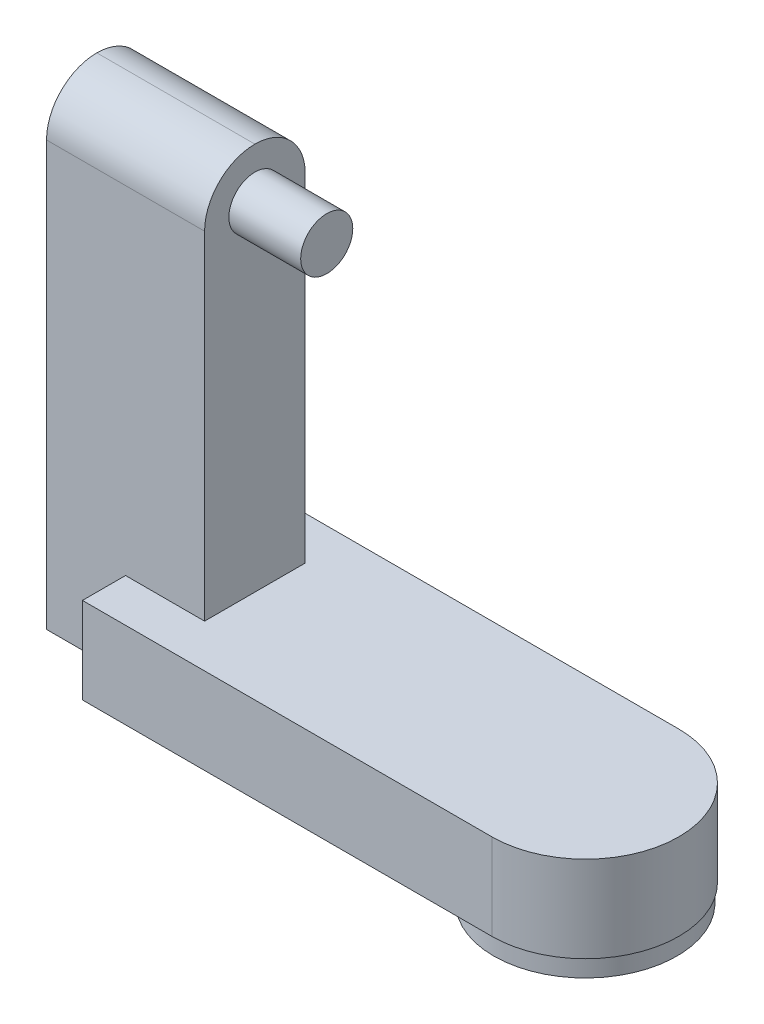
ISO-10303-21;
HEADER;
FILE_DESCRIPTION(('STEP AP214'),'2;1');
FILE_NAME('part.step','',(''),(''),'','','');
FILE_SCHEMA(('AUTOMOTIVE_DESIGN { 1 0 10303 214 1 1 1 1 }'));
ENDSEC;
DATA;
#1=APPLICATION_CONTEXT('core data for automotive mechanical design processes');
#2=APPLICATION_PROTOCOL_DEFINITION('international standard','automotive_design',2000,#1);
#3=PRODUCT_CONTEXT('',#1,'mechanical');
#4=PRODUCT('Part','Part','',(#3));
#5=PRODUCT_RELATED_PRODUCT_CATEGORY('part','',(#4));
#6=PRODUCT_DEFINITION_FORMATION('','',#4);
#7=PRODUCT_DEFINITION_CONTEXT('part definition',#1,'design');
#8=PRODUCT_DEFINITION('design','',#6,#7);
#9=PRODUCT_DEFINITION_SHAPE('','',#8);
#10=(LENGTH_UNIT() NAMED_UNIT(*) SI_UNIT(.MILLI.,.METRE.));
#11=(NAMED_UNIT(*) PLANE_ANGLE_UNIT() SI_UNIT($,.RADIAN.));
#12=(NAMED_UNIT(*) SI_UNIT($,.STERADIAN.) SOLID_ANGLE_UNIT());
#13=UNCERTAINTY_MEASURE_WITH_UNIT(LENGTH_MEASURE(1.E-05),#10,'distance_accuracy_value','');
#14=(GEOMETRIC_REPRESENTATION_CONTEXT(3) GLOBAL_UNCERTAINTY_ASSIGNED_CONTEXT((#13)) GLOBAL_UNIT_ASSIGNED_CONTEXT((#10,
#11,#12)) REPRESENTATION_CONTEXT('',''));
#15=CARTESIAN_POINT('',(0.,0.,0.));
#16=DIRECTION('',(0.,0.,1.));
#17=DIRECTION('',(1.,0.,0.));
#18=AXIS2_PLACEMENT_3D('',#15,#16,#17);
#19=CARTESIAN_POINT('',(-92.,132.,-14.));
#20=DIRECTION('',(-1.,0.,0.));
#21=DIRECTION('',(0.,0.,1.));
#22=AXIS2_PLACEMENT_3D('',#19,#20,#21);
#23=PLANE('',#22);
#24=DIRECTION('',(0.,-1.,0.));
#25=VECTOR('',#24,1.);
#26=CARTESIAN_POINT('',(-92.,132.,-14.));
#27=LINE('',#26,#25);
#28=CARTESIAN_POINT('',(-92.,118.,-14.));
#29=VERTEX_POINT('',#28);
#30=CARTESIAN_POINT('',(-92.,24.,-14.));
#31=VERTEX_POINT('',#30);
#32=EDGE_CURVE('E123',#29,#31,#27,.T.);
#33=ORIENTED_EDGE('',*,*,#32,.F.);
#34=CARTESIAN_POINT('',(-92.,118.,0.));
#35=DIRECTION('',(-1.,0.,0.));
#36=DIRECTION('',(0.,0.,1.));
#37=AXIS2_PLACEMENT_3D('',#34,#35,#36);
#38=CIRCLE('',#37,14.);
#39=CARTESIAN_POINT('',(-92.,132.,0.));
#40=VERTEX_POINT('',#39);
#41=EDGE_CURVE('E49',#29,#40,#38,.F.);
#42=ORIENTED_EDGE('',*,*,#41,.T.);
#43=CARTESIAN_POINT('',(-92.,118.,0.));
#44=DIRECTION('',(-1.,0.,0.));
#45=DIRECTION('',(0.,0.,1.));
#46=AXIS2_PLACEMENT_3D('',#43,#44,#45);
#47=CIRCLE('',#46,14.);
#48=CARTESIAN_POINT('',(-92.,118.,14.));
#49=VERTEX_POINT('',#48);
#50=EDGE_CURVE('E204',#40,#49,#47,.F.);
#51=ORIENTED_EDGE('',*,*,#50,.T.);
#52=DIRECTION('',(0.,-1.,0.));
#53=VECTOR('',#52,1.);
#54=CARTESIAN_POINT('',(-92.,132.,14.));
#55=LINE('',#54,#53);
#56=CARTESIAN_POINT('',(-92.,24.,14.));
#57=VERTEX_POINT('',#56);
#58=EDGE_CURVE('E141',#49,#57,#55,.T.);
#59=ORIENTED_EDGE('',*,*,#58,.T.);
#60=DIRECTION('',(0.,0.,1.));
#61=VECTOR('',#60,1.);
#62=CARTESIAN_POINT('',(-92.,24.,0.));
#63=LINE('',#62,#61);
#64=EDGE_CURVE('E191',#31,#57,#63,.T.);
#65=ORIENTED_EDGE('',*,*,#64,.F.);
#66=EDGE_LOOP('',(#33,#42,#51,#59,#65));
#67=FACE_BOUND('',#66,.T.);
#68=CARTESIAN_POINT('',(-92.,118.,0.));
#69=DIRECTION('',(-1.,0.,0.));
#70=DIRECTION('',(0.,0.,1.));
#71=AXIS2_PLACEMENT_3D('',#68,#69,#70);
#72=CIRCLE('',#71,7.25);
#73=CARTESIAN_POINT('',(-92.,118.,7.25000000000001));
#74=VERTEX_POINT('',#73);
#75=EDGE_CURVE('E11',#74,#74,#72,.F.);
#76=ORIENTED_EDGE('',*,*,#75,.F.);
#77=EDGE_LOOP('',(#76));
#78=FACE_BOUND('',#77,.T.);
#79=ADVANCED_FACE('F34',(#67,#78),#23,.F.);
#80=CARTESIAN_POINT('',(0.,118.,0.));
#81=DIRECTION('',(1.,0.,0.));
#82=DIRECTION('',(0.,0.,-1.));
#83=AXIS2_PLACEMENT_3D('',#80,#81,#82);
#84=CYLINDRICAL_SURFACE('',#83,14.);
#85=DIRECTION('',(1.,0.,0.));
#86=VECTOR('',#85,1.);
#87=CARTESIAN_POINT('',(0.,132.,0.));
#88=LINE('',#87,#86);
#89=CARTESIAN_POINT('',(-136.,132.,0.));
#90=VERTEX_POINT('',#89);
#91=EDGE_CURVE('E197',#90,#40,#88,.T.);
#92=ORIENTED_EDGE('',*,*,#91,.T.);
#93=ORIENTED_EDGE('',*,*,#41,.F.);
#94=DIRECTION('',(-1.,0.,0.));
#95=VECTOR('',#94,1.);
#96=CARTESIAN_POINT('',(0.,118.,-14.));
#97=LINE('',#96,#95);
#98=CARTESIAN_POINT('',(-136.,118.,-14.));
#99=VERTEX_POINT('',#98);
#100=EDGE_CURVE('E206',#99,#29,#97,.F.);
#101=ORIENTED_EDGE('',*,*,#100,.F.);
#102=CARTESIAN_POINT('',(-136.,118.,0.));
#103=DIRECTION('',(1.,0.,0.));
#104=DIRECTION('',(0.,0.,-1.));
#105=AXIS2_PLACEMENT_3D('',#102,#103,#104);
#106=CIRCLE('',#105,14.);
#107=EDGE_CURVE('E42',#90,#99,#106,.F.);
#108=ORIENTED_EDGE('',*,*,#107,.F.);
#109=EDGE_LOOP('',(#92,#93,#101,#108));
#110=FACE_BOUND('',#109,.T.);
#111=ADVANCED_FACE('F36',(#110),#84,.T.);
#112=CARTESIAN_POINT('',(0.,118.,0.));
#113=DIRECTION('',(-1.,0.,0.));
#114=DIRECTION('',(0.,0.,1.));
#115=AXIS2_PLACEMENT_3D('',#112,#113,#114);
#116=CYLINDRICAL_SURFACE('',#115,14.);
#117=ORIENTED_EDGE('',*,*,#91,.F.);
#118=CARTESIAN_POINT('',(-136.,118.,0.));
#119=DIRECTION('',(1.,0.,0.));
#120=DIRECTION('',(0.,0.,-1.));
#121=AXIS2_PLACEMENT_3D('',#118,#119,#120);
#122=CIRCLE('',#121,14.);
#123=CARTESIAN_POINT('',(-136.,118.,14.));
#124=VERTEX_POINT('',#123);
#125=EDGE_CURVE('E202',#124,#90,#122,.F.);
#126=ORIENTED_EDGE('',*,*,#125,.F.);
#127=DIRECTION('',(1.,0.,0.));
#128=VECTOR('',#127,1.);
#129=CARTESIAN_POINT('',(0.,118.,14.));
#130=LINE('',#129,#128);
#131=EDGE_CURVE('E199',#49,#124,#130,.F.);
#132=ORIENTED_EDGE('',*,*,#131,.F.);
#133=ORIENTED_EDGE('',*,*,#50,.F.);
#134=EDGE_LOOP('',(#117,#126,#132,#133));
#135=FACE_BOUND('',#134,.T.);
#136=ADVANCED_FACE('F216',(#135),#116,.T.);
#137=CARTESIAN_POINT('',(-114.,24.,-26.));
#138=DIRECTION('',(1.,0.,0.));
#139=DIRECTION('',(0.,0.,-1.));
#140=AXIS2_PLACEMENT_3D('',#137,#138,#139);
#141=PLANE('',#140);
#142=DIRECTION('',(0.,-1.,0.));
#143=VECTOR('',#142,1.);
#144=CARTESIAN_POINT('',(-114.,24.,-14.));
#145=LINE('',#144,#143);
#146=CARTESIAN_POINT('',(-114.,24.,-14.));
#147=VERTEX_POINT('',#146);
#148=CARTESIAN_POINT('',(-114.,0.,-14.));
#149=VERTEX_POINT('',#148);
#150=EDGE_CURVE('E130',#147,#149,#145,.T.);
#151=ORIENTED_EDGE('',*,*,#150,.F.);
#152=DIRECTION('',(0.,0.,1.));
#153=VECTOR('',#152,1.);
#154=CARTESIAN_POINT('',(-114.,24.,-26.));
#155=LINE('',#154,#153);
#156=CARTESIAN_POINT('',(-114.,24.,-26.));
#157=VERTEX_POINT('',#156);
#158=EDGE_CURVE('E155',#157,#147,#155,.T.);
#159=ORIENTED_EDGE('',*,*,#158,.F.);
#160=DIRECTION('',(0.,-1.,0.));
#161=VECTOR('',#160,1.);
#162=CARTESIAN_POINT('',(-114.,24.,-26.));
#163=LINE('',#162,#161);
#164=CARTESIAN_POINT('',(-114.,0.,-26.));
#165=VERTEX_POINT('',#164);
#166=EDGE_CURVE('E165',#157,#165,#163,.T.);
#167=ORIENTED_EDGE('',*,*,#166,.T.);
#168=DIRECTION('',(0.,0.,1.));
#169=VECTOR('',#168,1.);
#170=CARTESIAN_POINT('',(-114.,0.,-26.));
#171=LINE('',#170,#169);
#172=EDGE_CURVE('E166',#165,#149,#171,.T.);
#173=ORIENTED_EDGE('',*,*,#172,.T.);
#174=EDGE_LOOP('',(#151,#159,#167,#173));
#175=FACE_BOUND('',#174,.T.);
#176=ADVANCED_FACE('F225',(#175),#141,.F.);
#177=DIRECTION('',(0.,1.,0.));
#178=VECTOR('',#177,1.);
#179=CARTESIAN_POINT('',(-114.,24.,14.));
#180=LINE('',#179,#178);
#181=CARTESIAN_POINT('',(-114.,0.,14.));
#182=VERTEX_POINT('',#181);
#183=CARTESIAN_POINT('',(-114.,24.,14.));
#184=VERTEX_POINT('',#183);
#185=EDGE_CURVE('E148',#182,#184,#180,.T.);
#186=ORIENTED_EDGE('',*,*,#185,.F.);
#187=CARTESIAN_POINT('',(-114.,0.,26.));
#188=VERTEX_POINT('',#187);
#189=EDGE_CURVE('E154',#182,#188,#171,.T.);
#190=ORIENTED_EDGE('',*,*,#189,.T.);
#191=DIRECTION('',(0.,-1.,0.));
#192=VECTOR('',#191,1.);
#193=CARTESIAN_POINT('',(-114.,24.,26.));
#194=LINE('',#193,#192);
#195=CARTESIAN_POINT('',(-114.,24.,26.));
#196=VERTEX_POINT('',#195);
#197=EDGE_CURVE('E182',#196,#188,#194,.T.);
#198=ORIENTED_EDGE('',*,*,#197,.F.);
#199=EDGE_CURVE('E159',#184,#196,#155,.T.);
#200=ORIENTED_EDGE('',*,*,#199,.F.);
#201=EDGE_LOOP('',(#186,#190,#198,#200));
#202=FACE_BOUND('',#201,.T.);
#203=ADVANCED_FACE('F244',(#202),#141,.F.);
#204=CARTESIAN_POINT('',(0.,24.,0.));
#205=DIRECTION('',(0.,1.,0.));
#206=DIRECTION('',(0.,0.,1.));
#207=AXIS2_PLACEMENT_3D('',#204,#205,#206);
#208=PLANE('',#207);
#209=ORIENTED_EDGE('',*,*,#158,.T.);
#210=DIRECTION('',(1.,0.,0.));
#211=VECTOR('',#210,1.);
#212=CARTESIAN_POINT('',(0.,24.,-14.));
#213=LINE('',#212,#211);
#214=EDGE_CURVE('E194',#147,#31,#213,.T.);
#215=ORIENTED_EDGE('',*,*,#214,.T.);
#216=ORIENTED_EDGE('',*,*,#64,.T.);
#217=DIRECTION('',(-1.,0.,0.));
#218=VECTOR('',#217,1.);
#219=CARTESIAN_POINT('',(0.,24.,14.));
#220=LINE('',#219,#218);
#221=EDGE_CURVE('E188',#57,#184,#220,.T.);
#222=ORIENTED_EDGE('',*,*,#221,.T.);
#223=ORIENTED_EDGE('',*,*,#199,.T.);
#224=DIRECTION('',(1.,0.,0.));
#225=VECTOR('',#224,1.);
#226=CARTESIAN_POINT('',(-114.,24.,26.));
#227=LINE('',#226,#225);
#228=CARTESIAN_POINT('',(0.,24.,26.));
#229=VERTEX_POINT('',#228);
#230=EDGE_CURVE('E158',#196,#229,#227,.T.);
#231=ORIENTED_EDGE('',*,*,#230,.T.);
#232=CARTESIAN_POINT('',(0.,24.,0.));
#233=DIRECTION('',(0.,1.,0.));
#234=DIRECTION('',(0.,0.,1.));
#235=AXIS2_PLACEMENT_3D('',#232,#233,#234);
#236=CIRCLE('',#235,26.);
#237=CARTESIAN_POINT('',(0.,24.,-26.));
#238=VERTEX_POINT('',#237);
#239=EDGE_CURVE('E161',#229,#238,#236,.T.);
#240=ORIENTED_EDGE('',*,*,#239,.T.);
#241=DIRECTION('',(-1.,0.,0.));
#242=VECTOR('',#241,1.);
#243=CARTESIAN_POINT('',(-114.,24.,-26.));
#244=LINE('',#243,#242);
#245=EDGE_CURVE('E163',#238,#157,#244,.T.);
#246=ORIENTED_EDGE('',*,*,#245,.T.);
#247=EDGE_LOOP('',(#209,#215,#216,#222,#223,#231,#240,#246));
#248=FACE_BOUND('',#247,.T.);
#249=ADVANCED_FACE('F222',(#248),#208,.T.);
#250=CARTESIAN_POINT('',(0.,0.,0.));
#251=DIRECTION('',(0.,1.,0.));
#252=DIRECTION('',(0.,0.,1.));
#253=AXIS2_PLACEMENT_3D('',#250,#251,#252);
#254=PLANE('',#253);
#255=DIRECTION('',(-1.,0.,0.));
#256=VECTOR('',#255,1.);
#257=CARTESIAN_POINT('',(-136.,0.,-14.));
#258=LINE('',#257,#256);
#259=CARTESIAN_POINT('',(-136.,0.,-14.));
#260=VERTEX_POINT('',#259);
#261=EDGE_CURVE('E127',#149,#260,#258,.T.);
#262=ORIENTED_EDGE('',*,*,#261,.F.);
#263=ORIENTED_EDGE('',*,*,#172,.F.);
#264=DIRECTION('',(-1.,0.,0.));
#265=VECTOR('',#264,1.);
#266=CARTESIAN_POINT('',(-114.,0.,-26.));
#267=LINE('',#266,#265);
#268=CARTESIAN_POINT('',(0.,0.,-26.));
#269=VERTEX_POINT('',#268);
#270=EDGE_CURVE('E172',#269,#165,#267,.T.);
#271=ORIENTED_EDGE('',*,*,#270,.F.);
#272=CARTESIAN_POINT('',(0.,0.,0.));
#273=DIRECTION('',(0.,1.,0.));
#274=DIRECTION('',(0.,0.,1.));
#275=AXIS2_PLACEMENT_3D('',#272,#273,#274);
#276=CIRCLE('',#275,26.);
#277=CARTESIAN_POINT('',(0.,0.,26.));
#278=VERTEX_POINT('',#277);
#279=EDGE_CURVE('E170',#278,#269,#276,.T.);
#280=ORIENTED_EDGE('',*,*,#279,.F.);
#281=DIRECTION('',(1.,0.,0.));
#282=VECTOR('',#281,1.);
#283=CARTESIAN_POINT('',(-114.,0.,26.));
#284=LINE('',#283,#282);
#285=EDGE_CURVE('E168',#188,#278,#284,.T.);
#286=ORIENTED_EDGE('',*,*,#285,.F.);
#287=ORIENTED_EDGE('',*,*,#189,.F.);
#288=DIRECTION('',(1.,0.,0.));
#289=VECTOR('',#288,1.);
#290=CARTESIAN_POINT('',(-136.,0.,14.));
#291=LINE('',#290,#289);
#292=CARTESIAN_POINT('',(-136.,0.,14.));
#293=VERTEX_POINT('',#292);
#294=EDGE_CURVE('E139',#293,#182,#291,.T.);
#295=ORIENTED_EDGE('',*,*,#294,.F.);
#296=DIRECTION('',(0.,0.,1.));
#297=VECTOR('',#296,1.);
#298=CARTESIAN_POINT('',(-136.,0.,-14.));
#299=LINE('',#298,#297);
#300=EDGE_CURVE('E120',#260,#293,#299,.T.);
#301=ORIENTED_EDGE('',*,*,#300,.F.);
#302=EDGE_LOOP('',(#262,#263,#271,#280,#286,#287,#295,#301));
#303=FACE_BOUND('',#302,.T.);
#304=CARTESIAN_POINT('',(0.,0.,0.));
#305=DIRECTION('',(0.,1.,0.));
#306=DIRECTION('',(0.,0.,1.));
#307=AXIS2_PLACEMENT_3D('',#304,#305,#306);
#308=CIRCLE('',#307,25.5);
#309=CARTESIAN_POINT('',(0.,0.,25.5));
#310=VERTEX_POINT('',#309);
#311=EDGE_CURVE('E185',#310,#310,#308,.F.);
#312=ORIENTED_EDGE('',*,*,#311,.F.);
#313=EDGE_LOOP('',(#312));
#314=FACE_BOUND('',#313,.T.);
#315=ADVANCED_FACE('F136',(#303,#314),#254,.F.);
#316=CARTESIAN_POINT('',(-114.,24.,26.));
#317=DIRECTION('',(0.,0.,-1.));
#318=DIRECTION('',(-1.,0.,0.));
#319=AXIS2_PLACEMENT_3D('',#316,#317,#318);
#320=PLANE('',#319);
#321=ORIENTED_EDGE('',*,*,#285,.T.);
#322=DIRECTION('',(0.,-1.,0.));
#323=VECTOR('',#322,1.);
#324=CARTESIAN_POINT('',(0.,24.,26.));
#325=LINE('',#324,#323);
#326=EDGE_CURVE('E179',#229,#278,#325,.T.);
#327=ORIENTED_EDGE('',*,*,#326,.F.);
#328=ORIENTED_EDGE('',*,*,#230,.F.);
#329=ORIENTED_EDGE('',*,*,#197,.T.);
#330=EDGE_LOOP('',(#321,#327,#328,#329));
#331=FACE_BOUND('',#330,.T.);
#332=ADVANCED_FACE('F240',(#331),#320,.F.);
#333=CARTESIAN_POINT('',(0.,24.,0.));
#334=DIRECTION('',(0.,-1.,0.));
#335=DIRECTION('',(0.,0.,-1.));
#336=AXIS2_PLACEMENT_3D('',#333,#334,#335);
#337=CYLINDRICAL_SURFACE('',#336,26.);
#338=ORIENTED_EDGE('',*,*,#279,.T.);
#339=DIRECTION('',(0.,-1.,0.));
#340=VECTOR('',#339,1.);
#341=CARTESIAN_POINT('',(0.,24.,-26.));
#342=LINE('',#341,#340);
#343=EDGE_CURVE('E176',#238,#269,#342,.T.);
#344=ORIENTED_EDGE('',*,*,#343,.F.);
#345=ORIENTED_EDGE('',*,*,#239,.F.);
#346=ORIENTED_EDGE('',*,*,#326,.T.);
#347=EDGE_LOOP('',(#338,#344,#345,#346));
#348=FACE_BOUND('',#347,.T.);
#349=ADVANCED_FACE('F236',(#348),#337,.T.);
#350=CARTESIAN_POINT('',(-114.,24.,-26.));
#351=DIRECTION('',(0.,0.,1.));
#352=DIRECTION('',(1.,0.,0.));
#353=AXIS2_PLACEMENT_3D('',#350,#351,#352);
#354=PLANE('',#353);
#355=ORIENTED_EDGE('',*,*,#270,.T.);
#356=ORIENTED_EDGE('',*,*,#166,.F.);
#357=ORIENTED_EDGE('',*,*,#245,.F.);
#358=ORIENTED_EDGE('',*,*,#343,.T.);
#359=EDGE_LOOP('',(#355,#356,#357,#358));
#360=FACE_BOUND('',#359,.T.);
#361=ADVANCED_FACE('F231',(#360),#354,.F.);
#362=CARTESIAN_POINT('',(0.,-5.,0.));
#363=DIRECTION('',(0.,1.,0.));
#364=DIRECTION('',(0.,0.,1.));
#365=AXIS2_PLACEMENT_3D('',#362,#363,#364);
#366=CYLINDRICAL_SURFACE('',#365,25.5);
#367=CARTESIAN_POINT('',(0.,-5.,0.));
#368=DIRECTION('',(0.,-1.,0.));
#369=DIRECTION('',(0.,0.,-1.));
#370=AXIS2_PLACEMENT_3D('',#367,#368,#369);
#371=CIRCLE('',#370,25.5);
#372=CARTESIAN_POINT('',(0.,-5.,-25.5));
#373=VERTEX_POINT('',#372);
#374=EDGE_CURVE('E151',#373,#373,#371,.T.);
#375=ORIENTED_EDGE('',*,*,#374,.F.);
#376=EDGE_LOOP('',(#375));
#377=FACE_BOUND('',#376,.T.);
#378=ORIENTED_EDGE('',*,*,#311,.T.);
#379=EDGE_LOOP('',(#378));
#380=FACE_BOUND('',#379,.T.);
#381=ADVANCED_FACE('F265',(#377,#380),#366,.T.);
#382=CARTESIAN_POINT('',(0.,-5.,0.));
#383=DIRECTION('',(0.,-1.,0.));
#384=DIRECTION('',(0.,0.,-1.));
#385=AXIS2_PLACEMENT_3D('',#382,#383,#384);
#386=PLANE('',#385);
#387=ORIENTED_EDGE('',*,*,#374,.T.);
#388=EDGE_LOOP('',(#387));
#389=FACE_BOUND('',#388,.T.);
#390=ADVANCED_FACE('F262',(#389),#386,.T.);
#391=CARTESIAN_POINT('',(-136.,132.,-14.));
#392=DIRECTION('',(0.,0.,1.));
#393=DIRECTION('',(1.,0.,0.));
#394=AXIS2_PLACEMENT_3D('',#391,#392,#393);
#395=PLANE('',#394);
#396=DIRECTION('',(0.,-1.,0.));
#397=VECTOR('',#396,1.);
#398=CARTESIAN_POINT('',(-136.,132.,-14.));
#399=LINE('',#398,#397);
#400=EDGE_CURVE('E115',#99,#260,#399,.T.);
#401=ORIENTED_EDGE('',*,*,#400,.F.);
#402=ORIENTED_EDGE('',*,*,#100,.T.);
#403=ORIENTED_EDGE('',*,*,#32,.T.);
#404=ORIENTED_EDGE('',*,*,#214,.F.);
#405=ORIENTED_EDGE('',*,*,#150,.T.);
#406=ORIENTED_EDGE('',*,*,#261,.T.);
#407=EDGE_LOOP('',(#401,#402,#403,#404,#405,#406));
#408=FACE_BOUND('',#407,.T.);
#409=ADVANCED_FACE('F128',(#408),#395,.F.);
#410=CARTESIAN_POINT('',(-136.,132.,14.));
#411=DIRECTION('',(0.,0.,-1.));
#412=DIRECTION('',(-1.,0.,0.));
#413=AXIS2_PLACEMENT_3D('',#410,#411,#412);
#414=PLANE('',#413);
#415=ORIENTED_EDGE('',*,*,#58,.F.);
#416=ORIENTED_EDGE('',*,*,#131,.T.);
#417=DIRECTION('',(0.,-1.,0.));
#418=VECTOR('',#417,1.);
#419=CARTESIAN_POINT('',(-136.,132.,14.));
#420=LINE('',#419,#418);
#421=EDGE_CURVE('E124',#124,#293,#420,.T.);
#422=ORIENTED_EDGE('',*,*,#421,.T.);
#423=ORIENTED_EDGE('',*,*,#294,.T.);
#424=ORIENTED_EDGE('',*,*,#185,.T.);
#425=ORIENTED_EDGE('',*,*,#221,.F.);
#426=EDGE_LOOP('',(#415,#416,#422,#423,#424,#425));
#427=FACE_BOUND('',#426,.T.);
#428=ADVANCED_FACE('F219',(#427),#414,.F.);
#429=CARTESIAN_POINT('',(-136.,132.,-14.));
#430=DIRECTION('',(1.,0.,0.));
#431=DIRECTION('',(0.,0.,-1.));
#432=AXIS2_PLACEMENT_3D('',#429,#430,#431);
#433=PLANE('',#432);
#434=ORIENTED_EDGE('',*,*,#125,.T.);
#435=ORIENTED_EDGE('',*,*,#107,.T.);
#436=ORIENTED_EDGE('',*,*,#400,.T.);
#437=ORIENTED_EDGE('',*,*,#300,.T.);
#438=ORIENTED_EDGE('',*,*,#421,.F.);
#439=EDGE_LOOP('',(#434,#435,#436,#437,#438));
#440=FACE_BOUND('',#439,.T.);
#441=ADVANCED_FACE('F117',(#440),#433,.F.);
#442=CARTESIAN_POINT('',(-72.,118.,0.));
#443=DIRECTION('',(-1.,0.,0.));
#444=DIRECTION('',(0.,0.,1.));
#445=AXIS2_PLACEMENT_3D('',#442,#443,#444);
#446=CYLINDRICAL_SURFACE('',#445,7.25);
#447=CARTESIAN_POINT('',(-72.,118.,0.));
#448=DIRECTION('',(1.,0.,0.));
#449=DIRECTION('',(0.,0.,-1.));
#450=AXIS2_PLACEMENT_3D('',#447,#448,#449);
#451=CIRCLE('',#450,7.25);
#452=CARTESIAN_POINT('',(-72.,118.,-7.25));
#453=VERTEX_POINT('',#452);
#454=EDGE_CURVE('E134',#453,#453,#451,.T.);
#455=ORIENTED_EDGE('',*,*,#454,.F.);
#456=EDGE_LOOP('',(#455));
#457=FACE_BOUND('',#456,.T.);
#458=ORIENTED_EDGE('',*,*,#75,.T.);
#459=EDGE_LOOP('',(#458));
#460=FACE_BOUND('',#459,.T.);
#461=ADVANCED_FACE('F316',(#457,#460),#446,.T.);
#462=CARTESIAN_POINT('',(-72.,118.,0.));
#463=DIRECTION('',(1.,0.,0.));
#464=DIRECTION('',(0.,0.,-1.));
#465=AXIS2_PLACEMENT_3D('',#462,#463,#464);
#466=PLANE('',#465);
#467=ORIENTED_EDGE('',*,*,#454,.T.);
#468=EDGE_LOOP('',(#467));
#469=FACE_BOUND('',#468,.T.);
#470=ADVANCED_FACE('F322',(#469),#466,.T.);
#471=CLOSED_SHELL('',(#79,#111,#136,#176,#203,#249,#315,#332,#349,#361,#381,#390,#409,#428,#441,
#461,#470));
#472=MANIFOLD_SOLID_BREP('B2',#471);
#473=ADVANCED_BREP_SHAPE_REPRESENTATION('',(#18,#472),#14);
#474=SHAPE_DEFINITION_REPRESENTATION(#9,#473);
ENDSEC;
END-ISO-10303-21;
